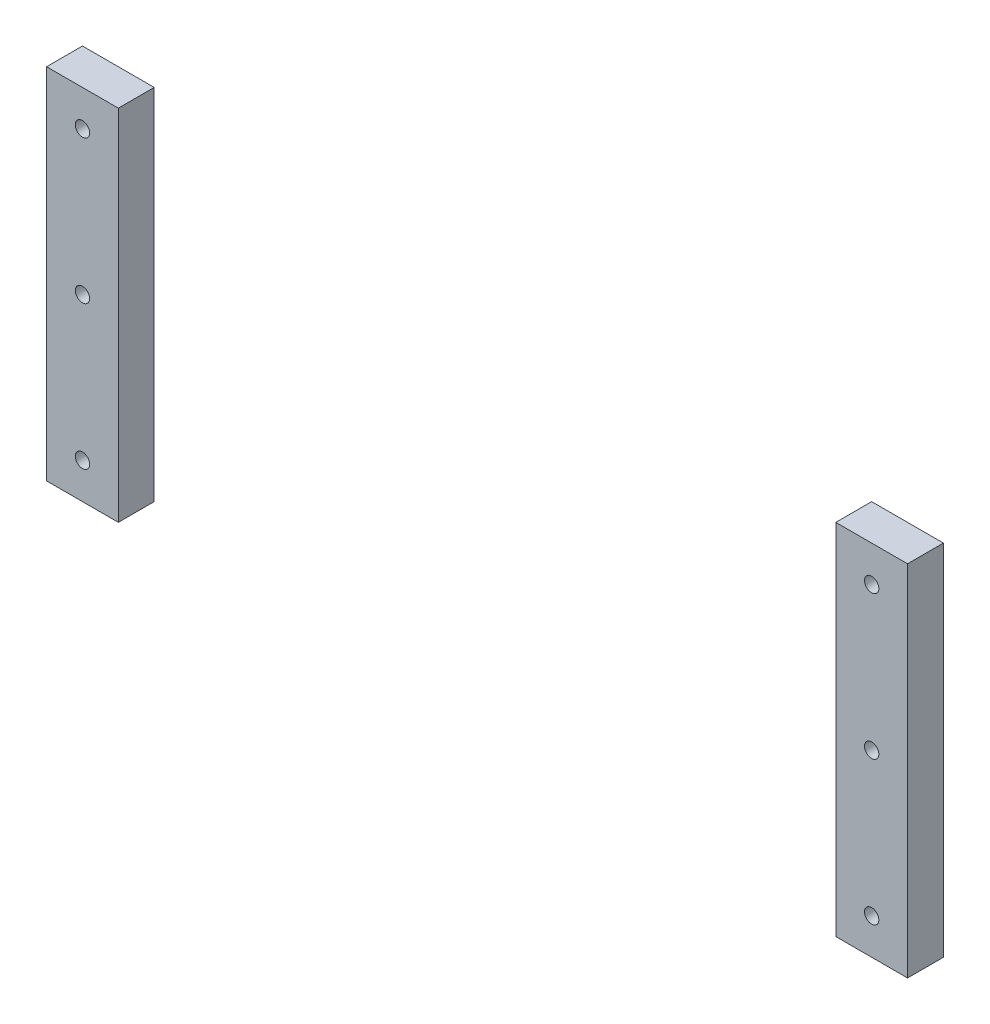
ISO-10303-21;
HEADER;
FILE_DESCRIPTION(('STEP AP214'),'2;1');
FILE_NAME('part.step','',(''),(''),'','','');
FILE_SCHEMA(('AUTOMOTIVE_DESIGN { 1 0 10303 214 1 1 1 1 }'));
ENDSEC;
DATA;
#1=APPLICATION_CONTEXT('core data for automotive mechanical design processes');
#2=APPLICATION_PROTOCOL_DEFINITION('international standard','automotive_design',2000,#1);
#3=PRODUCT_CONTEXT('',#1,'mechanical');
#4=PRODUCT('Part','Part','',(#3));
#5=PRODUCT_RELATED_PRODUCT_CATEGORY('part','',(#4));
#6=PRODUCT_DEFINITION_FORMATION('','',#4);
#7=PRODUCT_DEFINITION_CONTEXT('part definition',#1,'design');
#8=PRODUCT_DEFINITION('design','',#6,#7);
#9=PRODUCT_DEFINITION_SHAPE('','',#8);
#10=(LENGTH_UNIT() NAMED_UNIT(*) SI_UNIT(.MILLI.,.METRE.));
#11=(NAMED_UNIT(*) PLANE_ANGLE_UNIT() SI_UNIT($,.RADIAN.));
#12=(NAMED_UNIT(*) SI_UNIT($,.STERADIAN.) SOLID_ANGLE_UNIT());
#13=UNCERTAINTY_MEASURE_WITH_UNIT(LENGTH_MEASURE(1.E-05),#10,'distance_accuracy_value','');
#14=(GEOMETRIC_REPRESENTATION_CONTEXT(3) GLOBAL_UNCERTAINTY_ASSIGNED_CONTEXT((#13)) GLOBAL_UNIT_ASSIGNED_CONTEXT((#10,
#11,#12)) REPRESENTATION_CONTEXT('',''));
#15=CARTESIAN_POINT('',(0.,0.,0.));
#16=DIRECTION('',(0.,0.,1.));
#17=DIRECTION('',(1.,0.,0.));
#18=AXIS2_PLACEMENT_3D('',#15,#16,#17);
#19=CARTESIAN_POINT('',(200.,0.,10.));
#20=DIRECTION('',(1.,0.,0.));
#21=DIRECTION('',(0.,0.,-1.));
#22=AXIS2_PLACEMENT_3D('',#19,#20,#21);
#23=PLANE('',#22);
#24=DIRECTION('',(0.,-1.,0.));
#25=VECTOR('',#24,1.);
#26=CARTESIAN_POINT('',(200.,0.,0.));
#27=LINE('',#26,#25);
#28=CARTESIAN_POINT('',(200.,100.,0.));
#29=VERTEX_POINT('',#28);
#30=CARTESIAN_POINT('',(200.,0.,0.));
#31=VERTEX_POINT('',#30);
#32=EDGE_CURVE('E105',#29,#31,#27,.T.);
#33=ORIENTED_EDGE('',*,*,#32,.T.);
#34=DIRECTION('',(0.,0.,-1.));
#35=VECTOR('',#34,1.);
#36=CARTESIAN_POINT('',(200.,0.,10.));
#37=LINE('',#36,#35);
#38=CARTESIAN_POINT('',(200.,0.,10.));
#39=VERTEX_POINT('',#38);
#40=EDGE_CURVE('E12',#39,#31,#37,.T.);
#41=ORIENTED_EDGE('',*,*,#40,.F.);
#42=DIRECTION('',(0.,-1.,0.));
#43=VECTOR('',#42,1.);
#44=CARTESIAN_POINT('',(200.,0.,10.));
#45=LINE('',#44,#43);
#46=CARTESIAN_POINT('',(200.,100.,10.));
#47=VERTEX_POINT('',#46);
#48=EDGE_CURVE('E93',#47,#39,#45,.T.);
#49=ORIENTED_EDGE('',*,*,#48,.F.);
#50=DIRECTION('',(0.,0.,-1.));
#51=VECTOR('',#50,1.);
#52=CARTESIAN_POINT('',(200.,100.,10.));
#53=LINE('',#52,#51);
#54=EDGE_CURVE('E101',#47,#29,#53,.T.);
#55=ORIENTED_EDGE('',*,*,#54,.T.);
#56=EDGE_LOOP('',(#33,#41,#49,#55));
#57=FACE_BOUND('',#56,.T.);
#58=ADVANCED_FACE('F42',(#57),#23,.F.);
#59=CARTESIAN_POINT('',(200.,0.,10.));
#60=DIRECTION('',(0.,1.,0.));
#61=DIRECTION('',(0.,0.,1.));
#62=AXIS2_PLACEMENT_3D('',#59,#60,#61);
#63=PLANE('',#62);
#64=DIRECTION('',(1.,0.,0.));
#65=VECTOR('',#64,1.);
#66=CARTESIAN_POINT('',(200.,0.,0.));
#67=LINE('',#66,#65);
#68=CARTESIAN_POINT('',(220.,0.,0.));
#69=VERTEX_POINT('',#68);
#70=EDGE_CURVE('E97',#31,#69,#67,.T.);
#71=ORIENTED_EDGE('',*,*,#70,.T.);
#72=DIRECTION('',(0.,0.,-1.));
#73=VECTOR('',#72,1.);
#74=CARTESIAN_POINT('',(220.,0.,10.));
#75=LINE('',#74,#73);
#76=CARTESIAN_POINT('',(220.,0.,10.));
#77=VERTEX_POINT('',#76);
#78=EDGE_CURVE('E50',#77,#69,#75,.T.);
#79=ORIENTED_EDGE('',*,*,#78,.F.);
#80=DIRECTION('',(1.,0.,0.));
#81=VECTOR('',#80,1.);
#82=CARTESIAN_POINT('',(200.,0.,10.));
#83=LINE('',#82,#81);
#84=EDGE_CURVE('E88',#39,#77,#83,.T.);
#85=ORIENTED_EDGE('',*,*,#84,.F.);
#86=ORIENTED_EDGE('',*,*,#40,.T.);
#87=EDGE_LOOP('',(#71,#79,#85,#86));
#88=FACE_BOUND('',#87,.T.);
#89=ADVANCED_FACE('F96',(#88),#63,.F.);
#90=CARTESIAN_POINT('',(220.,0.,10.));
#91=DIRECTION('',(-1.,0.,0.));
#92=DIRECTION('',(0.,0.,1.));
#93=AXIS2_PLACEMENT_3D('',#90,#91,#92);
#94=PLANE('',#93);
#95=DIRECTION('',(0.,1.,0.));
#96=VECTOR('',#95,1.);
#97=CARTESIAN_POINT('',(220.,0.,0.));
#98=LINE('',#97,#96);
#99=CARTESIAN_POINT('',(220.,100.,0.));
#100=VERTEX_POINT('',#99);
#101=EDGE_CURVE('E75',#69,#100,#98,.T.);
#102=ORIENTED_EDGE('',*,*,#101,.T.);
#103=DIRECTION('',(0.,0.,-1.));
#104=VECTOR('',#103,1.);
#105=CARTESIAN_POINT('',(220.,100.,10.));
#106=LINE('',#105,#104);
#107=CARTESIAN_POINT('',(220.,100.,10.));
#108=VERTEX_POINT('',#107);
#109=EDGE_CURVE('E98',#108,#100,#106,.T.);
#110=ORIENTED_EDGE('',*,*,#109,.F.);
#111=DIRECTION('',(0.,1.,0.));
#112=VECTOR('',#111,1.);
#113=CARTESIAN_POINT('',(220.,0.,10.));
#114=LINE('',#113,#112);
#115=EDGE_CURVE('E91',#77,#108,#114,.T.);
#116=ORIENTED_EDGE('',*,*,#115,.F.);
#117=ORIENTED_EDGE('',*,*,#78,.T.);
#118=EDGE_LOOP('',(#102,#110,#116,#117));
#119=FACE_BOUND('',#118,.T.);
#120=ADVANCED_FACE('F99',(#119),#94,.F.);
#121=CARTESIAN_POINT('',(200.,100.,10.));
#122=DIRECTION('',(0.,-1.,0.));
#123=DIRECTION('',(0.,0.,-1.));
#124=AXIS2_PLACEMENT_3D('',#121,#122,#123);
#125=PLANE('',#124);
#126=DIRECTION('',(-1.,0.,0.));
#127=VECTOR('',#126,1.);
#128=CARTESIAN_POINT('',(200.,100.,0.));
#129=LINE('',#128,#127);
#130=EDGE_CURVE('E81',#100,#29,#129,.T.);
#131=ORIENTED_EDGE('',*,*,#130,.T.);
#132=ORIENTED_EDGE('',*,*,#54,.F.);
#133=DIRECTION('',(-1.,0.,0.));
#134=VECTOR('',#133,1.);
#135=CARTESIAN_POINT('',(200.,100.,10.));
#136=LINE('',#135,#134);
#137=EDGE_CURVE('E58',#108,#47,#136,.T.);
#138=ORIENTED_EDGE('',*,*,#137,.F.);
#139=ORIENTED_EDGE('',*,*,#109,.T.);
#140=EDGE_LOOP('',(#131,#132,#138,#139));
#141=FACE_BOUND('',#140,.T.);
#142=ADVANCED_FACE('F113',(#141),#125,.F.);
#143=CARTESIAN_POINT('',(0.,0.,10.));
#144=DIRECTION('',(0.,0.,-1.));
#145=DIRECTION('',(-1.,0.,0.));
#146=AXIS2_PLACEMENT_3D('',#143,#144,#145);
#147=PLANE('',#146);
#148=CARTESIAN_POINT('',(210.,10.,10.));
#149=DIRECTION('',(0.,0.,1.));
#150=DIRECTION('',(-1.,0.,0.));
#151=AXIS2_PLACEMENT_3D('',#148,#149,#150);
#152=CIRCLE('',#151,2.);
#153=CARTESIAN_POINT('',(208.,10.,10.));
#154=VERTEX_POINT('',#153);
#155=EDGE_CURVE('E131',#154,#154,#152,.T.);
#156=ORIENTED_EDGE('',*,*,#155,.F.);
#157=EDGE_LOOP('',(#156));
#158=FACE_BOUND('',#157,.T.);
#159=CARTESIAN_POINT('',(210.,50.,10.));
#160=DIRECTION('',(0.,0.,1.));
#161=DIRECTION('',(-1.,0.,0.));
#162=AXIS2_PLACEMENT_3D('',#159,#160,#161);
#163=CIRCLE('',#162,1.99999999999997);
#164=CARTESIAN_POINT('',(208.,50.,10.));
#165=VERTEX_POINT('',#164);
#166=EDGE_CURVE('E125',#165,#165,#163,.T.);
#167=ORIENTED_EDGE('',*,*,#166,.F.);
#168=EDGE_LOOP('',(#167));
#169=FACE_BOUND('',#168,.T.);
#170=CARTESIAN_POINT('',(210.,90.,10.));
#171=DIRECTION('',(0.,0.,1.));
#172=DIRECTION('',(-1.,0.,0.));
#173=AXIS2_PLACEMENT_3D('',#170,#171,#172);
#174=CIRCLE('',#173,2.00000000000002);
#175=CARTESIAN_POINT('',(208.,90.,10.));
#176=VERTEX_POINT('',#175);
#177=EDGE_CURVE('E119',#176,#176,#174,.T.);
#178=ORIENTED_EDGE('',*,*,#177,.F.);
#179=EDGE_LOOP('',(#178));
#180=FACE_BOUND('',#179,.T.);
#181=ORIENTED_EDGE('',*,*,#48,.T.);
#182=ORIENTED_EDGE('',*,*,#84,.T.);
#183=ORIENTED_EDGE('',*,*,#115,.T.);
#184=ORIENTED_EDGE('',*,*,#137,.T.);
#185=EDGE_LOOP('',(#181,#182,#183,#184));
#186=FACE_BOUND('',#185,.T.);
#187=ADVANCED_FACE('F89',(#158,#169,#180,#186),#147,.F.);
#188=CARTESIAN_POINT('',(0.,0.,0.));
#189=DIRECTION('',(0.,0.,-1.));
#190=DIRECTION('',(-1.,0.,0.));
#191=AXIS2_PLACEMENT_3D('',#188,#189,#190);
#192=PLANE('',#191);
#193=CARTESIAN_POINT('',(210.,10.,0.));
#194=DIRECTION('',(0.,0.,1.));
#195=DIRECTION('',(-1.,0.,0.));
#196=AXIS2_PLACEMENT_3D('',#193,#194,#195);
#197=CIRCLE('',#196,2.);
#198=CARTESIAN_POINT('',(208.,10.,0.));
#199=VERTEX_POINT('',#198);
#200=EDGE_CURVE('E108',#199,#199,#197,.T.);
#201=ORIENTED_EDGE('',*,*,#200,.T.);
#202=EDGE_LOOP('',(#201));
#203=FACE_BOUND('',#202,.T.);
#204=CARTESIAN_POINT('',(210.,50.,0.));
#205=DIRECTION('',(0.,0.,1.));
#206=DIRECTION('',(-1.,0.,0.));
#207=AXIS2_PLACEMENT_3D('',#204,#205,#206);
#208=CIRCLE('',#207,1.99999999999997);
#209=CARTESIAN_POINT('',(208.,50.,0.));
#210=VERTEX_POINT('',#209);
#211=EDGE_CURVE('E128',#210,#210,#208,.T.);
#212=ORIENTED_EDGE('',*,*,#211,.T.);
#213=EDGE_LOOP('',(#212));
#214=FACE_BOUND('',#213,.T.);
#215=CARTESIAN_POINT('',(210.,90.,0.));
#216=DIRECTION('',(0.,0.,1.));
#217=DIRECTION('',(-1.,0.,0.));
#218=AXIS2_PLACEMENT_3D('',#215,#216,#217);
#219=CIRCLE('',#218,2.00000000000002);
#220=CARTESIAN_POINT('',(208.,90.,0.));
#221=VERTEX_POINT('',#220);
#222=EDGE_CURVE('E122',#221,#221,#219,.T.);
#223=ORIENTED_EDGE('',*,*,#222,.T.);
#224=EDGE_LOOP('',(#223));
#225=FACE_BOUND('',#224,.T.);
#226=ORIENTED_EDGE('',*,*,#32,.F.);
#227=ORIENTED_EDGE('',*,*,#130,.F.);
#228=ORIENTED_EDGE('',*,*,#101,.F.);
#229=ORIENTED_EDGE('',*,*,#70,.F.);
#230=EDGE_LOOP('',(#226,#227,#228,#229));
#231=FACE_BOUND('',#230,.T.);
#232=ADVANCED_FACE('F116',(#203,#214,#225,#231),#192,.T.);
#233=CARTESIAN_POINT('',(210.,90.,0.));
#234=DIRECTION('',(0.,0.,1.));
#235=DIRECTION('',(1.,0.,0.));
#236=AXIS2_PLACEMENT_3D('',#233,#234,#235);
#237=CYLINDRICAL_SURFACE('',#236,2.00000000000002);
#238=ORIENTED_EDGE('',*,*,#222,.F.);
#239=EDGE_LOOP('',(#238));
#240=FACE_BOUND('',#239,.T.);
#241=ORIENTED_EDGE('',*,*,#177,.T.);
#242=EDGE_LOOP('',(#241));
#243=FACE_BOUND('',#242,.T.);
#244=ADVANCED_FACE('F153',(#240,#243),#237,.F.);
#245=CARTESIAN_POINT('',(210.,50.,0.));
#246=DIRECTION('',(0.,0.,1.));
#247=DIRECTION('',(1.,0.,0.));
#248=AXIS2_PLACEMENT_3D('',#245,#246,#247);
#249=CYLINDRICAL_SURFACE('',#248,1.99999999999997);
#250=ORIENTED_EDGE('',*,*,#211,.F.);
#251=EDGE_LOOP('',(#250));
#252=FACE_BOUND('',#251,.T.);
#253=ORIENTED_EDGE('',*,*,#166,.T.);
#254=EDGE_LOOP('',(#253));
#255=FACE_BOUND('',#254,.T.);
#256=ADVANCED_FACE('F142',(#252,#255),#249,.F.);
#257=CARTESIAN_POINT('',(210.,10.,0.));
#258=DIRECTION('',(0.,0.,1.));
#259=DIRECTION('',(1.,0.,0.));
#260=AXIS2_PLACEMENT_3D('',#257,#258,#259);
#261=CYLINDRICAL_SURFACE('',#260,2.);
#262=ORIENTED_EDGE('',*,*,#200,.F.);
#263=EDGE_LOOP('',(#262));
#264=FACE_BOUND('',#263,.T.);
#265=ORIENTED_EDGE('',*,*,#155,.T.);
#266=EDGE_LOOP('',(#265));
#267=FACE_BOUND('',#266,.T.);
#268=ADVANCED_FACE('F139',(#264,#267),#261,.F.);
#269=CLOSED_SHELL('',(#58,#89,#120,#142,#187,#232,#244,#256,#268));
#270=MANIFOLD_SOLID_BREP('B2',#269);
#271=CARTESIAN_POINT('',(-20.,0.,10.));
#272=DIRECTION('',(1.,0.,0.));
#273=DIRECTION('',(0.,1.,0.));
#274=AXIS2_PLACEMENT_3D('',#271,#272,#273);
#275=PLANE('',#274);
#276=DIRECTION('',(0.,-1.,0.));
#277=VECTOR('',#276,1.);
#278=CARTESIAN_POINT('',(-20.,0.,0.));
#279=LINE('',#278,#277);
#280=CARTESIAN_POINT('',(-20.,100.,0.));
#281=VERTEX_POINT('',#280);
#282=CARTESIAN_POINT('',(-20.,0.,0.));
#283=VERTEX_POINT('',#282);
#284=EDGE_CURVE('E291',#281,#283,#279,.T.);
#285=ORIENTED_EDGE('',*,*,#284,.T.);
#286=DIRECTION('',(0.,0.,-1.));
#287=VECTOR('',#286,1.);
#288=CARTESIAN_POINT('',(-20.,0.,10.));
#289=LINE('',#288,#287);
#290=CARTESIAN_POINT('',(-20.,0.,10.));
#291=VERTEX_POINT('',#290);
#292=EDGE_CURVE('E40',#291,#283,#289,.T.);
#293=ORIENTED_EDGE('',*,*,#292,.F.);
#294=DIRECTION('',(0.,-1.,0.));
#295=VECTOR('',#294,1.);
#296=CARTESIAN_POINT('',(-20.,0.,10.));
#297=LINE('',#296,#295);
#298=CARTESIAN_POINT('',(-20.,100.,10.));
#299=VERTEX_POINT('',#298);
#300=EDGE_CURVE('E279',#299,#291,#297,.T.);
#301=ORIENTED_EDGE('',*,*,#300,.F.);
#302=DIRECTION('',(0.,0.,-1.));
#303=VECTOR('',#302,1.);
#304=CARTESIAN_POINT('',(-20.,100.,10.));
#305=LINE('',#304,#303);
#306=EDGE_CURVE('E287',#299,#281,#305,.T.);
#307=ORIENTED_EDGE('',*,*,#306,.T.);
#308=EDGE_LOOP('',(#285,#293,#301,#307));
#309=FACE_BOUND('',#308,.T.);
#310=ADVANCED_FACE('F228',(#309),#275,.F.);
#311=CARTESIAN_POINT('',(-20.,0.,10.));
#312=DIRECTION('',(0.,1.,0.));
#313=DIRECTION('',(0.,0.,1.));
#314=AXIS2_PLACEMENT_3D('',#311,#312,#313);
#315=PLANE('',#314);
#316=DIRECTION('',(1.,0.,0.));
#317=VECTOR('',#316,1.);
#318=CARTESIAN_POINT('',(-20.,0.,0.));
#319=LINE('',#318,#317);
#320=CARTESIAN_POINT('',(0.,0.,0.));
#321=VERTEX_POINT('',#320);
#322=EDGE_CURVE('E283',#283,#321,#319,.T.);
#323=ORIENTED_EDGE('',*,*,#322,.T.);
#324=DIRECTION('',(0.,0.,-1.));
#325=VECTOR('',#324,1.);
#326=CARTESIAN_POINT('',(0.,0.,10.));
#327=LINE('',#326,#325);
#328=CARTESIAN_POINT('',(0.,0.,10.));
#329=VERTEX_POINT('',#328);
#330=EDGE_CURVE('E236',#329,#321,#327,.T.);
#331=ORIENTED_EDGE('',*,*,#330,.F.);
#332=DIRECTION('',(1.,0.,0.));
#333=VECTOR('',#332,1.);
#334=CARTESIAN_POINT('',(-20.,0.,10.));
#335=LINE('',#334,#333);
#336=EDGE_CURVE('E274',#291,#329,#335,.T.);
#337=ORIENTED_EDGE('',*,*,#336,.F.);
#338=ORIENTED_EDGE('',*,*,#292,.T.);
#339=EDGE_LOOP('',(#323,#331,#337,#338));
#340=FACE_BOUND('',#339,.T.);
#341=ADVANCED_FACE('F282',(#340),#315,.F.);
#342=CARTESIAN_POINT('',(0.,0.,10.));
#343=DIRECTION('',(-1.,0.,0.));
#344=DIRECTION('',(0.,-1.,0.));
#345=AXIS2_PLACEMENT_3D('',#342,#343,#344);
#346=PLANE('',#345);
#347=DIRECTION('',(0.,1.,0.));
#348=VECTOR('',#347,1.);
#349=CARTESIAN_POINT('',(0.,0.,0.));
#350=LINE('',#349,#348);
#351=CARTESIAN_POINT('',(0.,100.,0.));
#352=VERTEX_POINT('',#351);
#353=EDGE_CURVE('E261',#321,#352,#350,.T.);
#354=ORIENTED_EDGE('',*,*,#353,.T.);
#355=DIRECTION('',(0.,0.,-1.));
#356=VECTOR('',#355,1.);
#357=CARTESIAN_POINT('',(0.,100.,10.));
#358=LINE('',#357,#356);
#359=CARTESIAN_POINT('',(0.,100.,10.));
#360=VERTEX_POINT('',#359);
#361=EDGE_CURVE('E284',#360,#352,#358,.T.);
#362=ORIENTED_EDGE('',*,*,#361,.F.);
#363=DIRECTION('',(0.,1.,0.));
#364=VECTOR('',#363,1.);
#365=CARTESIAN_POINT('',(0.,0.,10.));
#366=LINE('',#365,#364);
#367=EDGE_CURVE('E277',#329,#360,#366,.T.);
#368=ORIENTED_EDGE('',*,*,#367,.F.);
#369=ORIENTED_EDGE('',*,*,#330,.T.);
#370=EDGE_LOOP('',(#354,#362,#368,#369));
#371=FACE_BOUND('',#370,.T.);
#372=ADVANCED_FACE('F285',(#371),#346,.F.);
#373=CARTESIAN_POINT('',(-20.,100.,10.));
#374=DIRECTION('',(0.,-1.,0.));
#375=DIRECTION('',(0.,0.,-1.));
#376=AXIS2_PLACEMENT_3D('',#373,#374,#375);
#377=PLANE('',#376);
#378=DIRECTION('',(-1.,0.,0.));
#379=VECTOR('',#378,1.);
#380=CARTESIAN_POINT('',(-20.,100.,0.));
#381=LINE('',#380,#379);
#382=EDGE_CURVE('E267',#352,#281,#381,.T.);
#383=ORIENTED_EDGE('',*,*,#382,.T.);
#384=ORIENTED_EDGE('',*,*,#306,.F.);
#385=DIRECTION('',(-1.,0.,0.));
#386=VECTOR('',#385,1.);
#387=CARTESIAN_POINT('',(-20.,100.,10.));
#388=LINE('',#387,#386);
#389=EDGE_CURVE('E244',#360,#299,#388,.T.);
#390=ORIENTED_EDGE('',*,*,#389,.F.);
#391=ORIENTED_EDGE('',*,*,#361,.T.);
#392=EDGE_LOOP('',(#383,#384,#390,#391));
#393=FACE_BOUND('',#392,.T.);
#394=ADVANCED_FACE('F299',(#393),#377,.F.);
#395=CARTESIAN_POINT('',(0.,0.,10.));
#396=DIRECTION('',(0.,0.,-1.));
#397=DIRECTION('',(-1.,0.,0.));
#398=AXIS2_PLACEMENT_3D('',#395,#396,#397);
#399=PLANE('',#398);
#400=CARTESIAN_POINT('',(-9.99999999999998,10.,10.));
#401=DIRECTION('',(0.,0.,1.));
#402=DIRECTION('',(1.,0.,0.));
#403=AXIS2_PLACEMENT_3D('',#400,#401,#402);
#404=CIRCLE('',#403,2.);
#405=CARTESIAN_POINT('',(-7.99999999999998,10.,10.));
#406=VERTEX_POINT('',#405);
#407=EDGE_CURVE('E317',#406,#406,#404,.T.);
#408=ORIENTED_EDGE('',*,*,#407,.F.);
#409=EDGE_LOOP('',(#408));
#410=FACE_BOUND('',#409,.T.);
#411=CARTESIAN_POINT('',(-10.,50.,10.));
#412=DIRECTION('',(0.,0.,1.));
#413=DIRECTION('',(1.,0.,0.));
#414=AXIS2_PLACEMENT_3D('',#411,#412,#413);
#415=CIRCLE('',#414,2.);
#416=CARTESIAN_POINT('',(-8.,50.,10.));
#417=VERTEX_POINT('',#416);
#418=EDGE_CURVE('E311',#417,#417,#415,.T.);
#419=ORIENTED_EDGE('',*,*,#418,.F.);
#420=EDGE_LOOP('',(#419));
#421=FACE_BOUND('',#420,.T.);
#422=CARTESIAN_POINT('',(-9.99999999999999,90.,10.));
#423=DIRECTION('',(0.,0.,1.));
#424=DIRECTION('',(1.,0.,0.));
#425=AXIS2_PLACEMENT_3D('',#422,#423,#424);
#426=CIRCLE('',#425,2.);
#427=CARTESIAN_POINT('',(-7.99999999999999,90.,10.));
#428=VERTEX_POINT('',#427);
#429=EDGE_CURVE('E305',#428,#428,#426,.T.);
#430=ORIENTED_EDGE('',*,*,#429,.F.);
#431=EDGE_LOOP('',(#430));
#432=FACE_BOUND('',#431,.T.);
#433=ORIENTED_EDGE('',*,*,#300,.T.);
#434=ORIENTED_EDGE('',*,*,#336,.T.);
#435=ORIENTED_EDGE('',*,*,#367,.T.);
#436=ORIENTED_EDGE('',*,*,#389,.T.);
#437=EDGE_LOOP('',(#433,#434,#435,#436));
#438=FACE_BOUND('',#437,.T.);
#439=ADVANCED_FACE('F275',(#410,#421,#432,#438),#399,.F.);
#440=CARTESIAN_POINT('',(0.,0.,0.));
#441=DIRECTION('',(0.,0.,-1.));
#442=DIRECTION('',(-1.,0.,0.));
#443=AXIS2_PLACEMENT_3D('',#440,#441,#442);
#444=PLANE('',#443);
#445=CARTESIAN_POINT('',(-9.99999999999998,10.,0.));
#446=DIRECTION('',(0.,0.,1.));
#447=DIRECTION('',(1.,0.,0.));
#448=AXIS2_PLACEMENT_3D('',#445,#446,#447);
#449=CIRCLE('',#448,2.);
#450=CARTESIAN_POINT('',(-7.99999999999998,10.,0.));
#451=VERTEX_POINT('',#450);
#452=EDGE_CURVE('E294',#451,#451,#449,.T.);
#453=ORIENTED_EDGE('',*,*,#452,.T.);
#454=EDGE_LOOP('',(#453));
#455=FACE_BOUND('',#454,.T.);
#456=CARTESIAN_POINT('',(-10.,50.,0.));
#457=DIRECTION('',(0.,0.,1.));
#458=DIRECTION('',(1.,0.,0.));
#459=AXIS2_PLACEMENT_3D('',#456,#457,#458);
#460=CIRCLE('',#459,2.);
#461=CARTESIAN_POINT('',(-8.,50.,0.));
#462=VERTEX_POINT('',#461);
#463=EDGE_CURVE('E314',#462,#462,#460,.T.);
#464=ORIENTED_EDGE('',*,*,#463,.T.);
#465=EDGE_LOOP('',(#464));
#466=FACE_BOUND('',#465,.T.);
#467=CARTESIAN_POINT('',(-9.99999999999999,90.,0.));
#468=DIRECTION('',(0.,0.,1.));
#469=DIRECTION('',(1.,0.,0.));
#470=AXIS2_PLACEMENT_3D('',#467,#468,#469);
#471=CIRCLE('',#470,2.);
#472=CARTESIAN_POINT('',(-7.99999999999999,90.,0.));
#473=VERTEX_POINT('',#472);
#474=EDGE_CURVE('E308',#473,#473,#471,.T.);
#475=ORIENTED_EDGE('',*,*,#474,.T.);
#476=EDGE_LOOP('',(#475));
#477=FACE_BOUND('',#476,.T.);
#478=ORIENTED_EDGE('',*,*,#284,.F.);
#479=ORIENTED_EDGE('',*,*,#382,.F.);
#480=ORIENTED_EDGE('',*,*,#353,.F.);
#481=ORIENTED_EDGE('',*,*,#322,.F.);
#482=EDGE_LOOP('',(#478,#479,#480,#481));
#483=FACE_BOUND('',#482,.T.);
#484=ADVANCED_FACE('F302',(#455,#466,#477,#483),#444,.T.);
#485=CARTESIAN_POINT('',(-9.99999999999999,90.,0.));
#486=DIRECTION('',(0.,0.,1.));
#487=DIRECTION('',(1.,0.,0.));
#488=AXIS2_PLACEMENT_3D('',#485,#486,#487);
#489=CYLINDRICAL_SURFACE('',#488,2.);
#490=ORIENTED_EDGE('',*,*,#474,.F.);
#491=EDGE_LOOP('',(#490));
#492=FACE_BOUND('',#491,.T.);
#493=ORIENTED_EDGE('',*,*,#429,.T.);
#494=EDGE_LOOP('',(#493));
#495=FACE_BOUND('',#494,.T.);
#496=ADVANCED_FACE('F339',(#492,#495),#489,.F.);
#497=CARTESIAN_POINT('',(-10.,50.,0.));
#498=DIRECTION('',(0.,0.,1.));
#499=DIRECTION('',(1.,0.,0.));
#500=AXIS2_PLACEMENT_3D('',#497,#498,#499);
#501=CYLINDRICAL_SURFACE('',#500,2.);
#502=ORIENTED_EDGE('',*,*,#463,.F.);
#503=EDGE_LOOP('',(#502));
#504=FACE_BOUND('',#503,.T.);
#505=ORIENTED_EDGE('',*,*,#418,.T.);
#506=EDGE_LOOP('',(#505));
#507=FACE_BOUND('',#506,.T.);
#508=ADVANCED_FACE('F328',(#504,#507),#501,.F.);
#509=CARTESIAN_POINT('',(-9.99999999999998,10.,0.));
#510=DIRECTION('',(0.,0.,1.));
#511=DIRECTION('',(1.,0.,0.));
#512=AXIS2_PLACEMENT_3D('',#509,#510,#511);
#513=CYLINDRICAL_SURFACE('',#512,2.);
#514=ORIENTED_EDGE('',*,*,#452,.F.);
#515=EDGE_LOOP('',(#514));
#516=FACE_BOUND('',#515,.T.);
#517=ORIENTED_EDGE('',*,*,#407,.T.);
#518=EDGE_LOOP('',(#517));
#519=FACE_BOUND('',#518,.T.);
#520=ADVANCED_FACE('F325',(#516,#519),#513,.F.);
#521=CLOSED_SHELL('',(#310,#341,#372,#394,#439,#484,#496,#508,#520));
#522=MANIFOLD_SOLID_BREP('B6',#521);
#523=ADVANCED_BREP_SHAPE_REPRESENTATION('',(#18,#270,#522),#14);
#524=SHAPE_DEFINITION_REPRESENTATION(#9,#523);
ENDSEC;
END-ISO-10303-21;
